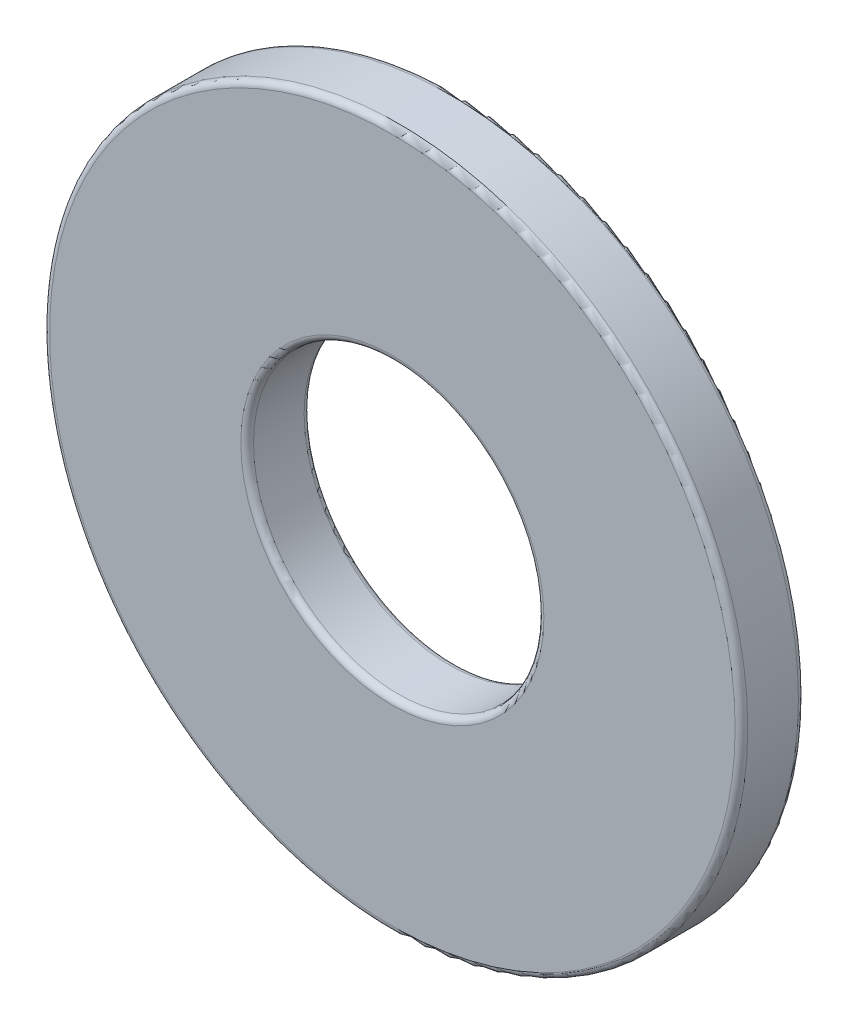
ISO-10303-21;
HEADER;
FILE_DESCRIPTION(('STEP AP214'),'2;1');
FILE_NAME('part.step','',(''),(''),'','','');
FILE_SCHEMA(('AUTOMOTIVE_DESIGN { 1 0 10303 214 1 1 1 1 }'));
ENDSEC;
DATA;
#1=APPLICATION_CONTEXT('core data for automotive mechanical design processes');
#2=APPLICATION_PROTOCOL_DEFINITION('international standard','automotive_design',2000,#1);
#3=PRODUCT_CONTEXT('',#1,'mechanical');
#4=PRODUCT('Part','Part','',(#3));
#5=PRODUCT_RELATED_PRODUCT_CATEGORY('part','',(#4));
#6=PRODUCT_DEFINITION_FORMATION('','',#4);
#7=PRODUCT_DEFINITION_CONTEXT('part definition',#1,'design');
#8=PRODUCT_DEFINITION('design','',#6,#7);
#9=PRODUCT_DEFINITION_SHAPE('','',#8);
#10=(LENGTH_UNIT() NAMED_UNIT(*) SI_UNIT(.MILLI.,.METRE.));
#11=(NAMED_UNIT(*) PLANE_ANGLE_UNIT() SI_UNIT($,.RADIAN.));
#12=(NAMED_UNIT(*) SI_UNIT($,.STERADIAN.) SOLID_ANGLE_UNIT());
#13=UNCERTAINTY_MEASURE_WITH_UNIT(LENGTH_MEASURE(1.E-05),#10,'distance_accuracy_value','');
#14=(GEOMETRIC_REPRESENTATION_CONTEXT(3) GLOBAL_UNCERTAINTY_ASSIGNED_CONTEXT((#13)) GLOBAL_UNIT_ASSIGNED_CONTEXT((#10,
#11,#12)) REPRESENTATION_CONTEXT('',''));
#15=CARTESIAN_POINT('',(0.,0.,0.));
#16=DIRECTION('',(0.,0.,1.));
#17=DIRECTION('',(1.,0.,0.));
#18=AXIS2_PLACEMENT_3D('',#15,#16,#17);
#19=CARTESIAN_POINT('',(0.,0.,-0.8636));
#20=DIRECTION('',(0.,0.,1.));
#21=DIRECTION('',(1.,0.,0.));
#22=AXIS2_PLACEMENT_3D('',#19,#20,#21);
#23=CYLINDRICAL_SURFACE('',#22,9.525);
#24=CARTESIAN_POINT('',(0.,0.,-0.69088));
#25=DIRECTION('',(0.,0.,1.));
#26=DIRECTION('',(1.,0.,0.));
#27=AXIS2_PLACEMENT_3D('',#24,#25,#26);
#28=CIRCLE('',#27,9.525);
#29=CARTESIAN_POINT('',(9.525,0.,-0.69088));
#30=VERTEX_POINT('',#29);
#31=EDGE_CURVE('E61',#30,#30,#28,.T.);
#32=ORIENTED_EDGE('',*,*,#31,.T.);
#33=EDGE_LOOP('',(#32));
#34=FACE_BOUND('',#33,.T.);
#35=CARTESIAN_POINT('',(0.,0.,0.69088));
#36=DIRECTION('',(0.,0.,1.));
#37=DIRECTION('',(1.,0.,0.));
#38=AXIS2_PLACEMENT_3D('',#35,#36,#37);
#39=CIRCLE('',#38,9.525);
#40=CARTESIAN_POINT('',(9.525,0.,0.69088));
#41=VERTEX_POINT('',#40);
#42=EDGE_CURVE('E64',#41,#41,#39,.F.);
#43=ORIENTED_EDGE('',*,*,#42,.T.);
#44=EDGE_LOOP('',(#43));
#45=FACE_BOUND('',#44,.T.);
#46=ADVANCED_FACE('F35',(#34,#45),#23,.T.);
#47=CARTESIAN_POINT('',(0.,0.,-0.8636));
#48=DIRECTION('',(0.,0.,1.));
#49=DIRECTION('',(1.,0.,0.));
#50=AXIS2_PLACEMENT_3D('',#47,#48,#49);
#51=PLANE('',#50);
#52=CARTESIAN_POINT('',(0.,0.,-0.8636));
#53=DIRECTION('',(0.,0.,1.));
#54=DIRECTION('',(1.,0.,0.));
#55=AXIS2_PLACEMENT_3D('',#52,#53,#54);
#56=CIRCLE('',#55,9.35228);
#57=CARTESIAN_POINT('',(9.35228,0.,-0.8636));
#58=VERTEX_POINT('',#57);
#59=EDGE_CURVE('E55',#58,#58,#56,.F.);
#60=ORIENTED_EDGE('',*,*,#59,.T.);
#61=EDGE_LOOP('',(#60));
#62=FACE_BOUND('',#61,.T.);
#63=CARTESIAN_POINT('',(0.,0.,-0.8636));
#64=DIRECTION('',(0.,0.,1.));
#65=DIRECTION('',(1.,0.,0.));
#66=AXIS2_PLACEMENT_3D('',#63,#64,#65);
#67=CIRCLE('',#66,4.13512);
#68=CARTESIAN_POINT('',(4.13512,0.,-0.8636));
#69=VERTEX_POINT('',#68);
#70=EDGE_CURVE('E58',#69,#69,#67,.T.);
#71=ORIENTED_EDGE('',*,*,#70,.T.);
#72=EDGE_LOOP('',(#71));
#73=FACE_BOUND('',#72,.T.);
#74=ADVANCED_FACE('F78',(#62,#73),#51,.F.);
#75=CARTESIAN_POINT('',(0.,0.,-0.8636));
#76=DIRECTION('',(0.,0.,1.));
#77=DIRECTION('',(1.,0.,0.));
#78=AXIS2_PLACEMENT_3D('',#75,#76,#77);
#79=CYLINDRICAL_SURFACE('',#78,3.9624);
#80=CARTESIAN_POINT('',(0.,0.,-0.69088));
#81=DIRECTION('',(0.,0.,1.));
#82=DIRECTION('',(1.,0.,0.));
#83=AXIS2_PLACEMENT_3D('',#80,#81,#82);
#84=CIRCLE('',#83,3.9624);
#85=CARTESIAN_POINT('',(3.9624,0.,-0.69088));
#86=VERTEX_POINT('',#85);
#87=EDGE_CURVE('E46',#86,#86,#84,.F.);
#88=ORIENTED_EDGE('',*,*,#87,.T.);
#89=EDGE_LOOP('',(#88));
#90=FACE_BOUND('',#89,.T.);
#91=CARTESIAN_POINT('',(0.,0.,0.69088));
#92=DIRECTION('',(0.,0.,1.));
#93=DIRECTION('',(1.,0.,0.));
#94=AXIS2_PLACEMENT_3D('',#91,#92,#93);
#95=CIRCLE('',#94,3.9624);
#96=CARTESIAN_POINT('',(3.9624,0.,0.69088));
#97=VERTEX_POINT('',#96);
#98=EDGE_CURVE('E50',#97,#97,#95,.T.);
#99=ORIENTED_EDGE('',*,*,#98,.T.);
#100=EDGE_LOOP('',(#99));
#101=FACE_BOUND('',#100,.T.);
#102=ADVANCED_FACE('F84',(#90,#101),#79,.F.);
#103=CARTESIAN_POINT('',(0.,0.,0.8636));
#104=DIRECTION('',(0.,0.,1.));
#105=DIRECTION('',(1.,0.,0.));
#106=AXIS2_PLACEMENT_3D('',#103,#104,#105);
#107=PLANE('',#106);
#108=CARTESIAN_POINT('',(0.,0.,0.8636));
#109=DIRECTION('',(0.,0.,1.));
#110=DIRECTION('',(1.,0.,0.));
#111=AXIS2_PLACEMENT_3D('',#108,#109,#110);
#112=CIRCLE('',#111,4.13512);
#113=CARTESIAN_POINT('',(4.13512,0.,0.8636));
#114=VERTEX_POINT('',#113);
#115=EDGE_CURVE('E10',#114,#114,#112,.F.);
#116=ORIENTED_EDGE('',*,*,#115,.T.);
#117=EDGE_LOOP('',(#116));
#118=FACE_BOUND('',#117,.T.);
#119=CARTESIAN_POINT('',(0.,0.,0.8636));
#120=DIRECTION('',(0.,0.,1.));
#121=DIRECTION('',(1.,0.,0.));
#122=AXIS2_PLACEMENT_3D('',#119,#120,#121);
#123=CIRCLE('',#122,9.35228);
#124=CARTESIAN_POINT('',(9.35228,0.,0.8636));
#125=VERTEX_POINT('',#124);
#126=EDGE_CURVE('E42',#125,#125,#123,.T.);
#127=ORIENTED_EDGE('',*,*,#126,.T.);
#128=EDGE_LOOP('',(#127));
#129=FACE_BOUND('',#128,.T.);
#130=ADVANCED_FACE('F92',(#118,#129),#107,.T.);
#131=CARTESIAN_POINT('',(0.,0.,-0.69088));
#132=DIRECTION('',(0.,0.,1.));
#133=DIRECTION('',(1.,0.,0.));
#134=AXIS2_PLACEMENT_3D('',#131,#132,#133);
#135=TOROIDAL_SURFACE('',#134,9.35228,0.17272);
#136=ORIENTED_EDGE('',*,*,#59,.F.);
#137=EDGE_LOOP('',(#136));
#138=FACE_BOUND('',#137,.T.);
#139=ORIENTED_EDGE('',*,*,#31,.F.);
#140=EDGE_LOOP('',(#139));
#141=FACE_BOUND('',#140,.T.);
#142=ADVANCED_FACE('F89',(#138,#141),#135,.T.);
#143=CARTESIAN_POINT('',(0.,0.,-0.69088));
#144=DIRECTION('',(0.,0.,1.));
#145=DIRECTION('',(1.,0.,0.));
#146=AXIS2_PLACEMENT_3D('',#143,#144,#145);
#147=TOROIDAL_SURFACE('',#146,4.13512,0.17272);
#148=ORIENTED_EDGE('',*,*,#87,.F.);
#149=EDGE_LOOP('',(#148));
#150=FACE_BOUND('',#149,.T.);
#151=ORIENTED_EDGE('',*,*,#70,.F.);
#152=EDGE_LOOP('',(#151));
#153=FACE_BOUND('',#152,.T.);
#154=ADVANCED_FACE('F75',(#150,#153),#147,.T.);
#155=CARTESIAN_POINT('',(0.,0.,0.69088));
#156=DIRECTION('',(0.,0.,1.));
#157=DIRECTION('',(1.,0.,0.));
#158=AXIS2_PLACEMENT_3D('',#155,#156,#157);
#159=TOROIDAL_SURFACE('',#158,4.13512,0.17272);
#160=ORIENTED_EDGE('',*,*,#115,.F.);
#161=EDGE_LOOP('',(#160));
#162=FACE_BOUND('',#161,.T.);
#163=ORIENTED_EDGE('',*,*,#98,.F.);
#164=EDGE_LOOP('',(#163));
#165=FACE_BOUND('',#164,.T.);
#166=ADVANCED_FACE('F71',(#162,#165),#159,.T.);
#167=CARTESIAN_POINT('',(0.,0.,0.69088));
#168=DIRECTION('',(0.,0.,1.));
#169=DIRECTION('',(1.,0.,0.));
#170=AXIS2_PLACEMENT_3D('',#167,#168,#169);
#171=TOROIDAL_SURFACE('',#170,9.35228,0.17272);
#172=ORIENTED_EDGE('',*,*,#42,.F.);
#173=EDGE_LOOP('',(#172));
#174=FACE_BOUND('',#173,.T.);
#175=ORIENTED_EDGE('',*,*,#126,.F.);
#176=EDGE_LOOP('',(#175));
#177=FACE_BOUND('',#176,.T.);
#178=ADVANCED_FACE('F37',(#174,#177),#171,.T.);
#179=CLOSED_SHELL('',(#46,#74,#102,#130,#142,#154,#166,#178));
#180=MANIFOLD_SOLID_BREP('B2',#179);
#181=ADVANCED_BREP_SHAPE_REPRESENTATION('',(#18,#180),#14);
#182=SHAPE_DEFINITION_REPRESENTATION(#9,#181);
ENDSEC;
END-ISO-10303-21;
